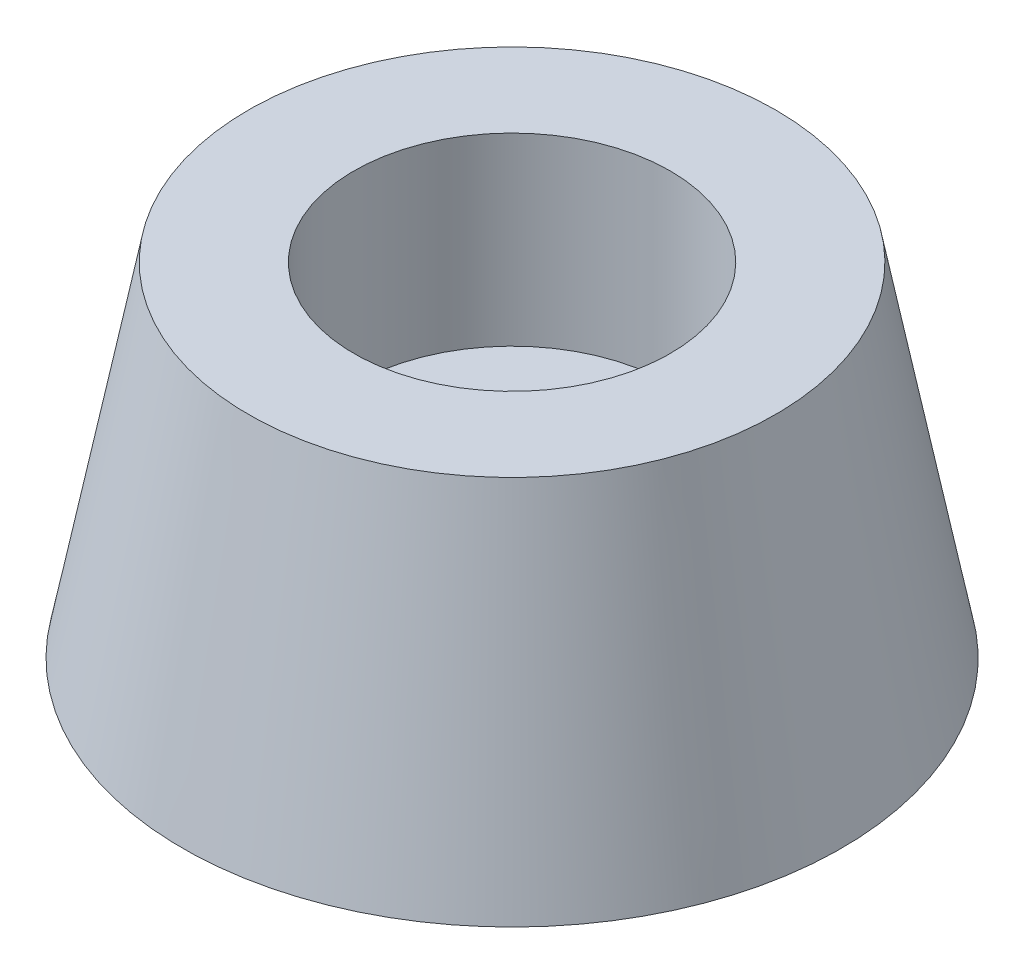
ISO-10303-21;
HEADER;
FILE_DESCRIPTION(('STEP AP214'),'2;1');
FILE_NAME('part.step','',(''),(''),'','','');
FILE_SCHEMA(('AUTOMOTIVE_DESIGN { 1 0 10303 214 1 1 1 1 }'));
ENDSEC;
DATA;
#1=APPLICATION_CONTEXT('core data for automotive mechanical design processes');
#2=APPLICATION_PROTOCOL_DEFINITION('international standard','automotive_design',2000,#1);
#3=PRODUCT_CONTEXT('',#1,'mechanical');
#4=PRODUCT('Part','Part','',(#3));
#5=PRODUCT_RELATED_PRODUCT_CATEGORY('part','',(#4));
#6=PRODUCT_DEFINITION_FORMATION('','',#4);
#7=PRODUCT_DEFINITION_CONTEXT('part definition',#1,'design');
#8=PRODUCT_DEFINITION('design','',#6,#7);
#9=PRODUCT_DEFINITION_SHAPE('','',#8);
#10=(LENGTH_UNIT() NAMED_UNIT(*) SI_UNIT(.MILLI.,.METRE.));
#11=(NAMED_UNIT(*) PLANE_ANGLE_UNIT() SI_UNIT($,.RADIAN.));
#12=(NAMED_UNIT(*) SI_UNIT($,.STERADIAN.) SOLID_ANGLE_UNIT());
#13=UNCERTAINTY_MEASURE_WITH_UNIT(LENGTH_MEASURE(1.E-05),#10,'distance_accuracy_value','');
#14=(GEOMETRIC_REPRESENTATION_CONTEXT(3) GLOBAL_UNCERTAINTY_ASSIGNED_CONTEXT((#13)) GLOBAL_UNIT_ASSIGNED_CONTEXT((#10,
#11,#12)) REPRESENTATION_CONTEXT('',''));
#15=CARTESIAN_POINT('',(0.,0.,0.));
#16=DIRECTION('',(0.,0.,1.));
#17=DIRECTION('',(1.,0.,0.));
#18=AXIS2_PLACEMENT_3D('',#15,#16,#17);
#19=CARTESIAN_POINT('',(0.,13.,0.));
#20=DIRECTION('',(0.,-1.,0.));
#21=DIRECTION('',(0.,0.,-1.));
#22=AXIS2_PLACEMENT_3D('',#19,#20,#21);
#23=CONICAL_SURFACE('',#22,10.,0.189988287918716);
#24=CARTESIAN_POINT('',(0.,0.,0.));
#25=DIRECTION('',(0.,-1.,0.));
#26=DIRECTION('',(0.,0.,-1.));
#27=AXIS2_PLACEMENT_3D('',#24,#25,#26);
#28=CIRCLE('',#27,12.5);
#29=CARTESIAN_POINT('',(0.,0.,-12.5));
#30=VERTEX_POINT('',#29);
#31=EDGE_CURVE('E56',#30,#30,#28,.T.);
#32=ORIENTED_EDGE('',*,*,#31,.F.);
#33=EDGE_LOOP('',(#32));
#34=FACE_BOUND('',#33,.T.);
#35=CARTESIAN_POINT('',(0.,13.,0.));
#36=DIRECTION('',(0.,-1.,0.));
#37=DIRECTION('',(0.,0.,-1.));
#38=AXIS2_PLACEMENT_3D('',#35,#36,#37);
#39=CIRCLE('',#38,10.);
#40=CARTESIAN_POINT('',(0.,13.,-10.));
#41=VERTEX_POINT('',#40);
#42=EDGE_CURVE('E10',#41,#41,#39,.T.);
#43=ORIENTED_EDGE('',*,*,#42,.T.);
#44=EDGE_LOOP('',(#43));
#45=FACE_BOUND('',#44,.T.);
#46=ADVANCED_FACE('F34',(#34,#45),#23,.T.);
#47=CARTESIAN_POINT('',(-10.,13.,0.));
#48=DIRECTION('',(0.,-1.,0.));
#49=DIRECTION('',(0.,0.,-1.));
#50=AXIS2_PLACEMENT_3D('',#47,#48,#49);
#51=PLANE('',#50);
#52=ORIENTED_EDGE('',*,*,#42,.F.);
#53=EDGE_LOOP('',(#52));
#54=FACE_BOUND('',#53,.T.);
#55=CARTESIAN_POINT('',(0.,13.,0.));
#56=DIRECTION('',(0.,-1.,0.));
#57=DIRECTION('',(0.,0.,-1.));
#58=AXIS2_PLACEMENT_3D('',#55,#56,#57);
#59=CIRCLE('',#58,6.);
#60=CARTESIAN_POINT('',(0.,13.,-6.));
#61=VERTEX_POINT('',#60);
#62=EDGE_CURVE('E40',#61,#61,#59,.T.);
#63=ORIENTED_EDGE('',*,*,#62,.T.);
#64=EDGE_LOOP('',(#63));
#65=FACE_BOUND('',#64,.T.);
#66=ADVANCED_FACE('F63',(#54,#65),#51,.F.);
#67=CARTESIAN_POINT('',(0.,0.,0.));
#68=DIRECTION('',(0.,-1.,0.));
#69=DIRECTION('',(0.,0.,-1.));
#70=AXIS2_PLACEMENT_3D('',#67,#68,#69);
#71=CYLINDRICAL_SURFACE('',#70,6.);
#72=ORIENTED_EDGE('',*,*,#62,.F.);
#73=EDGE_LOOP('',(#72));
#74=FACE_BOUND('',#73,.T.);
#75=CARTESIAN_POINT('',(0.,6.,0.));
#76=DIRECTION('',(0.,-1.,0.));
#77=DIRECTION('',(0.,0.,-1.));
#78=AXIS2_PLACEMENT_3D('',#75,#76,#77);
#79=CIRCLE('',#78,6.);
#80=CARTESIAN_POINT('',(0.,6.,-6.));
#81=VERTEX_POINT('',#80);
#82=EDGE_CURVE('E44',#81,#81,#79,.T.);
#83=ORIENTED_EDGE('',*,*,#82,.T.);
#84=EDGE_LOOP('',(#83));
#85=FACE_BOUND('',#84,.T.);
#86=ADVANCED_FACE('F67',(#74,#85),#71,.F.);
#87=CARTESIAN_POINT('',(-6.,6.,0.));
#88=DIRECTION('',(0.,-1.,0.));
#89=DIRECTION('',(0.,0.,-1.));
#90=AXIS2_PLACEMENT_3D('',#87,#88,#89);
#91=PLANE('',#90);
#92=ORIENTED_EDGE('',*,*,#82,.F.);
#93=EDGE_LOOP('',(#92));
#94=FACE_BOUND('',#93,.T.);
#95=CARTESIAN_POINT('',(0.,6.,0.));
#96=DIRECTION('',(0.,-1.,0.));
#97=DIRECTION('',(0.,0.,-1.));
#98=AXIS2_PLACEMENT_3D('',#95,#96,#97);
#99=CIRCLE('',#98,3.);
#100=CARTESIAN_POINT('',(0.,6.,-3.));
#101=VERTEX_POINT('',#100);
#102=EDGE_CURVE('E48',#101,#101,#99,.T.);
#103=ORIENTED_EDGE('',*,*,#102,.T.);
#104=EDGE_LOOP('',(#103));
#105=FACE_BOUND('',#104,.T.);
#106=ADVANCED_FACE('F72',(#94,#105),#91,.F.);
#107=CARTESIAN_POINT('',(0.,0.,0.));
#108=DIRECTION('',(0.,-1.,0.));
#109=DIRECTION('',(0.,0.,-1.));
#110=AXIS2_PLACEMENT_3D('',#107,#108,#109);
#111=CYLINDRICAL_SURFACE('',#110,3.);
#112=ORIENTED_EDGE('',*,*,#102,.F.);
#113=EDGE_LOOP('',(#112));
#114=FACE_BOUND('',#113,.T.);
#115=CARTESIAN_POINT('',(0.,0.,0.));
#116=DIRECTION('',(0.,-1.,0.));
#117=DIRECTION('',(0.,0.,-1.));
#118=AXIS2_PLACEMENT_3D('',#115,#116,#117);
#119=CIRCLE('',#118,3.);
#120=CARTESIAN_POINT('',(0.,0.,-3.));
#121=VERTEX_POINT('',#120);
#122=EDGE_CURVE('E53',#121,#121,#119,.T.);
#123=ORIENTED_EDGE('',*,*,#122,.T.);
#124=EDGE_LOOP('',(#123));
#125=FACE_BOUND('',#124,.T.);
#126=ADVANCED_FACE('F78',(#114,#125),#111,.F.);
#127=CARTESIAN_POINT('',(-3.,0.,0.));
#128=DIRECTION('',(0.,1.,0.));
#129=DIRECTION('',(0.,0.,1.));
#130=AXIS2_PLACEMENT_3D('',#127,#128,#129);
#131=PLANE('',#130);
#132=ORIENTED_EDGE('',*,*,#122,.F.);
#133=EDGE_LOOP('',(#132));
#134=FACE_BOUND('',#133,.T.);
#135=ORIENTED_EDGE('',*,*,#31,.T.);
#136=EDGE_LOOP('',(#135));
#137=FACE_BOUND('',#136,.T.);
#138=ADVANCED_FACE('F60',(#134,#137),#131,.F.);
#139=CLOSED_SHELL('',(#46,#66,#86,#106,#126,#138));
#140=MANIFOLD_SOLID_BREP('B2',#139);
#141=ADVANCED_BREP_SHAPE_REPRESENTATION('',(#18,#140),#14);
#142=SHAPE_DEFINITION_REPRESENTATION(#9,#141);
ENDSEC;
END-ISO-10303-21;
